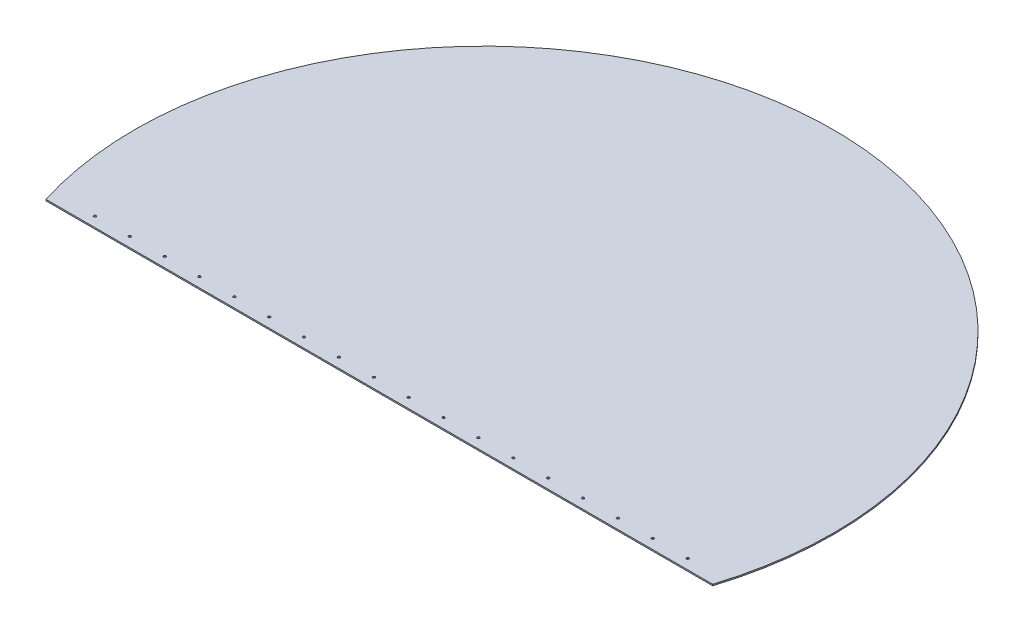
ISO-10303-21;
HEADER;
FILE_DESCRIPTION(('STEP AP214'),'2;1');
FILE_NAME('part.step','',(''),(''),'','','');
FILE_SCHEMA(('AUTOMOTIVE_DESIGN { 1 0 10303 214 1 1 1 1 }'));
ENDSEC;
DATA;
#1=APPLICATION_CONTEXT('core data for automotive mechanical design processes');
#2=APPLICATION_PROTOCOL_DEFINITION('international standard','automotive_design',2000,#1);
#3=PRODUCT_CONTEXT('',#1,'mechanical');
#4=PRODUCT('Part','Part','',(#3));
#5=PRODUCT_RELATED_PRODUCT_CATEGORY('part','',(#4));
#6=PRODUCT_DEFINITION_FORMATION('','',#4);
#7=PRODUCT_DEFINITION_CONTEXT('part definition',#1,'design');
#8=PRODUCT_DEFINITION('design','',#6,#7);
#9=PRODUCT_DEFINITION_SHAPE('','',#8);
#10=(LENGTH_UNIT() NAMED_UNIT(*) SI_UNIT(.MILLI.,.METRE.));
#11=(NAMED_UNIT(*) PLANE_ANGLE_UNIT() SI_UNIT($,.RADIAN.));
#12=(NAMED_UNIT(*) SI_UNIT($,.STERADIAN.) SOLID_ANGLE_UNIT());
#13=UNCERTAINTY_MEASURE_WITH_UNIT(LENGTH_MEASURE(1.E-05),#10,'distance_accuracy_value','');
#14=(GEOMETRIC_REPRESENTATION_CONTEXT(3) GLOBAL_UNCERTAINTY_ASSIGNED_CONTEXT((#13)) GLOBAL_UNIT_ASSIGNED_CONTEXT((#10,
#11,#12)) REPRESENTATION_CONTEXT('',''));
#15=CARTESIAN_POINT('',(0.,0.,0.));
#16=DIRECTION('',(0.,0.,1.));
#17=DIRECTION('',(1.,0.,0.));
#18=AXIS2_PLACEMENT_3D('',#15,#16,#17);
#19=CARTESIAN_POINT('',(0.,1.98374,0.));
#20=DIRECTION('',(0.,-1.,0.));
#21=DIRECTION('',(0.,0.,-1.));
#22=AXIS2_PLACEMENT_3D('',#19,#20,#21);
#23=CYLINDRICAL_SURFACE('',#22,508.9906);
#24=CARTESIAN_POINT('',(0.,0.,0.));
#25=DIRECTION('',(0.,1.,0.));
#26=DIRECTION('',(0.,0.,1.));
#27=AXIS2_PLACEMENT_3D('',#24,#25,#26);
#28=CIRCLE('',#27,508.9906);
#29=CARTESIAN_POINT('',(485.639445358756,0.,152.4));
#30=VERTEX_POINT('',#29);
#31=CARTESIAN_POINT('',(-485.639445358756,0.,152.4));
#32=VERTEX_POINT('',#31);
#33=EDGE_CURVE('E66',#30,#32,#28,.T.);
#34=ORIENTED_EDGE('',*,*,#33,.T.);
#35=DIRECTION('',(0.,-1.,0.));
#36=VECTOR('',#35,1.);
#37=CARTESIAN_POINT('',(-485.639445358756,1.98374,152.4));
#38=LINE('',#37,#36);
#39=CARTESIAN_POINT('',(-485.639445358756,1.98374,152.4));
#40=VERTEX_POINT('',#39);
#41=EDGE_CURVE('E11',#40,#32,#38,.T.);
#42=ORIENTED_EDGE('',*,*,#41,.F.);
#43=CARTESIAN_POINT('',(0.,1.98374,0.));
#44=DIRECTION('',(0.,1.,0.));
#45=DIRECTION('',(0.,0.,1.));
#46=AXIS2_PLACEMENT_3D('',#43,#44,#45);
#47=CIRCLE('',#46,508.9906);
#48=CARTESIAN_POINT('',(485.639445358756,1.98374,152.4));
#49=VERTEX_POINT('',#48);
#50=EDGE_CURVE('E65',#49,#40,#47,.T.);
#51=ORIENTED_EDGE('',*,*,#50,.F.);
#52=DIRECTION('',(0.,-1.,0.));
#53=VECTOR('',#52,1.);
#54=CARTESIAN_POINT('',(485.639445358756,1.98374,152.4));
#55=LINE('',#54,#53);
#56=EDGE_CURVE('E42',#49,#30,#55,.T.);
#57=ORIENTED_EDGE('',*,*,#56,.T.);
#58=EDGE_LOOP('',(#34,#42,#51,#57));
#59=FACE_BOUND('',#58,.T.);
#60=ADVANCED_FACE('F33',(#59),#23,.T.);
#61=CARTESIAN_POINT('',(-485.639445358756,1.98374,152.4));
#62=DIRECTION('',(0.,0.,-1.));
#63=DIRECTION('',(-1.,0.,0.));
#64=AXIS2_PLACEMENT_3D('',#61,#62,#63);
#65=PLANE('',#64);
#66=DIRECTION('',(1.,0.,0.));
#67=VECTOR('',#66,1.);
#68=CARTESIAN_POINT('',(-485.639445358756,0.,152.4));
#69=LINE('',#68,#67);
#70=EDGE_CURVE('E58',#32,#30,#69,.T.);
#71=ORIENTED_EDGE('',*,*,#70,.T.);
#72=ORIENTED_EDGE('',*,*,#56,.F.);
#73=DIRECTION('',(1.,0.,0.));
#74=VECTOR('',#73,1.);
#75=CARTESIAN_POINT('',(-485.639445358756,1.98374,152.4));
#76=LINE('',#75,#74);
#77=EDGE_CURVE('E50',#40,#49,#76,.T.);
#78=ORIENTED_EDGE('',*,*,#77,.F.);
#79=ORIENTED_EDGE('',*,*,#41,.T.);
#80=EDGE_LOOP('',(#71,#72,#78,#79));
#81=FACE_BOUND('',#80,.T.);
#82=ADVANCED_FACE('F61',(#81),#65,.F.);
#83=CARTESIAN_POINT('',(0.,1.98374,0.));
#84=DIRECTION('',(0.,1.,0.));
#85=DIRECTION('',(0.,0.,1.));
#86=AXIS2_PLACEMENT_3D('',#83,#84,#85);
#87=PLANE('',#86);
#88=CARTESIAN_POINT('',(-428.760554641244,1.98374,138.1125));
#89=DIRECTION('',(0.,1.,0.));
#90=DIRECTION('',(0.,0.,1.));
#91=AXIS2_PLACEMENT_3D('',#88,#89,#90);
#92=CIRCLE('',#91,1.77799999999998);
#93=CARTESIAN_POINT('',(-428.760554641244,1.98374,139.8905));
#94=VERTEX_POINT('',#93);
#95=EDGE_CURVE('E150',#94,#94,#92,.T.);
#96=ORIENTED_EDGE('',*,*,#95,.F.);
#97=EDGE_LOOP('',(#96));
#98=FACE_BOUND('',#97,.T.);
#99=CARTESIAN_POINT('',(-377.960554641244,1.98374,138.1125));
#100=DIRECTION('',(0.,1.,0.));
#101=DIRECTION('',(0.,0.,1.));
#102=AXIS2_PLACEMENT_3D('',#99,#100,#101);
#103=CIRCLE('',#102,1.77799999999998);
#104=CARTESIAN_POINT('',(-377.960554641244,1.98374,139.8905));
#105=VERTEX_POINT('',#104);
#106=EDGE_CURVE('E140',#105,#105,#103,.T.);
#107=ORIENTED_EDGE('',*,*,#106,.F.);
#108=EDGE_LOOP('',(#107));
#109=FACE_BOUND('',#108,.T.);
#110=CARTESIAN_POINT('',(-327.160554641244,1.98374,138.1125));
#111=DIRECTION('',(0.,1.,0.));
#112=DIRECTION('',(0.,0.,1.));
#113=AXIS2_PLACEMENT_3D('',#110,#111,#112);
#114=CIRCLE('',#113,1.77799999999998);
#115=CARTESIAN_POINT('',(-327.160554641244,1.98374,139.8905));
#116=VERTEX_POINT('',#115);
#117=EDGE_CURVE('E137',#116,#116,#114,.T.);
#118=ORIENTED_EDGE('',*,*,#117,.F.);
#119=EDGE_LOOP('',(#118));
#120=FACE_BOUND('',#119,.T.);
#121=CARTESIAN_POINT('',(-276.360554641244,1.98374,138.1125));
#122=DIRECTION('',(0.,1.,0.));
#123=DIRECTION('',(0.,0.,1.));
#124=AXIS2_PLACEMENT_3D('',#121,#122,#123);
#125=CIRCLE('',#124,1.77799999999998);
#126=CARTESIAN_POINT('',(-276.360554641244,1.98374,139.8905));
#127=VERTEX_POINT('',#126);
#128=EDGE_CURVE('E134',#127,#127,#125,.T.);
#129=ORIENTED_EDGE('',*,*,#128,.F.);
#130=EDGE_LOOP('',(#129));
#131=FACE_BOUND('',#130,.T.);
#132=CARTESIAN_POINT('',(-225.560554641244,1.98374,138.1125));
#133=DIRECTION('',(0.,1.,0.));
#134=DIRECTION('',(0.,0.,1.));
#135=AXIS2_PLACEMENT_3D('',#132,#133,#134);
#136=CIRCLE('',#135,1.77799999999998);
#137=CARTESIAN_POINT('',(-225.560554641244,1.98374,139.8905));
#138=VERTEX_POINT('',#137);
#139=EDGE_CURVE('E130',#138,#138,#136,.T.);
#140=ORIENTED_EDGE('',*,*,#139,.F.);
#141=EDGE_LOOP('',(#140));
#142=FACE_BOUND('',#141,.T.);
#143=CARTESIAN_POINT('',(-174.760554641244,1.98374,138.1125));
#144=DIRECTION('',(0.,1.,0.));
#145=DIRECTION('',(0.,0.,1.));
#146=AXIS2_PLACEMENT_3D('',#143,#144,#145);
#147=CIRCLE('',#146,1.77799999999998);
#148=CARTESIAN_POINT('',(-174.760554641244,1.98374,139.8905));
#149=VERTEX_POINT('',#148);
#150=EDGE_CURVE('E126',#149,#149,#147,.T.);
#151=ORIENTED_EDGE('',*,*,#150,.F.);
#152=EDGE_LOOP('',(#151));
#153=FACE_BOUND('',#152,.T.);
#154=CARTESIAN_POINT('',(-123.960554641244,1.98374,138.1125));
#155=DIRECTION('',(0.,1.,0.));
#156=DIRECTION('',(0.,0.,1.));
#157=AXIS2_PLACEMENT_3D('',#154,#155,#156);
#158=CIRCLE('',#157,1.77799999999998);
#159=CARTESIAN_POINT('',(-123.960554641244,1.98374,139.8905));
#160=VERTEX_POINT('',#159);
#161=EDGE_CURVE('E122',#160,#160,#158,.T.);
#162=ORIENTED_EDGE('',*,*,#161,.F.);
#163=EDGE_LOOP('',(#162));
#164=FACE_BOUND('',#163,.T.);
#165=CARTESIAN_POINT('',(-73.1605546412441,1.98374,138.1125));
#166=DIRECTION('',(0.,1.,0.));
#167=DIRECTION('',(0.,0.,1.));
#168=AXIS2_PLACEMENT_3D('',#165,#166,#167);
#169=CIRCLE('',#168,1.77799999999998);
#170=CARTESIAN_POINT('',(-73.1605546412441,1.98374,139.8905));
#171=VERTEX_POINT('',#170);
#172=EDGE_CURVE('E118',#171,#171,#169,.T.);
#173=ORIENTED_EDGE('',*,*,#172,.F.);
#174=EDGE_LOOP('',(#173));
#175=FACE_BOUND('',#174,.T.);
#176=CARTESIAN_POINT('',(-22.3605546412441,1.98374,138.1125));
#177=DIRECTION('',(0.,1.,0.));
#178=DIRECTION('',(0.,0.,1.));
#179=AXIS2_PLACEMENT_3D('',#176,#177,#178);
#180=CIRCLE('',#179,1.77799999999998);
#181=CARTESIAN_POINT('',(-22.3605546412441,1.98374,139.8905));
#182=VERTEX_POINT('',#181);
#183=EDGE_CURVE('E114',#182,#182,#180,.T.);
#184=ORIENTED_EDGE('',*,*,#183,.F.);
#185=EDGE_LOOP('',(#184));
#186=FACE_BOUND('',#185,.T.);
#187=CARTESIAN_POINT('',(28.4394453587559,1.98374,138.1125));
#188=DIRECTION('',(0.,1.,0.));
#189=DIRECTION('',(0.,0.,1.));
#190=AXIS2_PLACEMENT_3D('',#187,#188,#189);
#191=CIRCLE('',#190,1.77799999999998);
#192=CARTESIAN_POINT('',(28.4394453587559,1.98374,139.8905));
#193=VERTEX_POINT('',#192);
#194=EDGE_CURVE('E110',#193,#193,#191,.T.);
#195=ORIENTED_EDGE('',*,*,#194,.F.);
#196=EDGE_LOOP('',(#195));
#197=FACE_BOUND('',#196,.T.);
#198=CARTESIAN_POINT('',(79.2394453587559,1.98374,138.1125));
#199=DIRECTION('',(0.,1.,0.));
#200=DIRECTION('',(0.,0.,1.));
#201=AXIS2_PLACEMENT_3D('',#198,#199,#200);
#202=CIRCLE('',#201,1.77799999999998);
#203=CARTESIAN_POINT('',(79.2394453587559,1.98374,139.8905));
#204=VERTEX_POINT('',#203);
#205=EDGE_CURVE('E106',#204,#204,#202,.T.);
#206=ORIENTED_EDGE('',*,*,#205,.F.);
#207=EDGE_LOOP('',(#206));
#208=FACE_BOUND('',#207,.T.);
#209=CARTESIAN_POINT('',(130.039445358756,1.98374,138.1125));
#210=DIRECTION('',(0.,1.,0.));
#211=DIRECTION('',(0.,0.,1.));
#212=AXIS2_PLACEMENT_3D('',#209,#210,#211);
#213=CIRCLE('',#212,1.77799999999998);
#214=CARTESIAN_POINT('',(130.039445358756,1.98374,139.8905));
#215=VERTEX_POINT('',#214);
#216=EDGE_CURVE('E102',#215,#215,#213,.T.);
#217=ORIENTED_EDGE('',*,*,#216,.F.);
#218=EDGE_LOOP('',(#217));
#219=FACE_BOUND('',#218,.T.);
#220=CARTESIAN_POINT('',(180.839445358756,1.98374,138.1125));
#221=DIRECTION('',(0.,1.,0.));
#222=DIRECTION('',(0.,0.,1.));
#223=AXIS2_PLACEMENT_3D('',#220,#221,#222);
#224=CIRCLE('',#223,1.77799999999998);
#225=CARTESIAN_POINT('',(180.839445358756,1.98374,139.8905));
#226=VERTEX_POINT('',#225);
#227=EDGE_CURVE('E98',#226,#226,#224,.T.);
#228=ORIENTED_EDGE('',*,*,#227,.F.);
#229=EDGE_LOOP('',(#228));
#230=FACE_BOUND('',#229,.T.);
#231=CARTESIAN_POINT('',(231.639445358756,1.98374,138.1125));
#232=DIRECTION('',(0.,1.,0.));
#233=DIRECTION('',(0.,0.,1.));
#234=AXIS2_PLACEMENT_3D('',#231,#232,#233);
#235=CIRCLE('',#234,1.77799999999998);
#236=CARTESIAN_POINT('',(231.639445358756,1.98374,139.8905));
#237=VERTEX_POINT('',#236);
#238=EDGE_CURVE('E94',#237,#237,#235,.T.);
#239=ORIENTED_EDGE('',*,*,#238,.F.);
#240=EDGE_LOOP('',(#239));
#241=FACE_BOUND('',#240,.T.);
#242=CARTESIAN_POINT('',(282.439445358756,1.98374,138.1125));
#243=DIRECTION('',(0.,1.,0.));
#244=DIRECTION('',(0.,0.,1.));
#245=AXIS2_PLACEMENT_3D('',#242,#243,#244);
#246=CIRCLE('',#245,1.77799999999998);
#247=CARTESIAN_POINT('',(282.439445358756,1.98374,139.8905));
#248=VERTEX_POINT('',#247);
#249=EDGE_CURVE('E90',#248,#248,#246,.T.);
#250=ORIENTED_EDGE('',*,*,#249,.F.);
#251=EDGE_LOOP('',(#250));
#252=FACE_BOUND('',#251,.T.);
#253=CARTESIAN_POINT('',(333.239445358756,1.98374,138.1125));
#254=DIRECTION('',(0.,1.,0.));
#255=DIRECTION('',(0.,0.,1.));
#256=AXIS2_PLACEMENT_3D('',#253,#254,#255);
#257=CIRCLE('',#256,1.77799999999998);
#258=CARTESIAN_POINT('',(333.239445358756,1.98374,139.8905));
#259=VERTEX_POINT('',#258);
#260=EDGE_CURVE('E86',#259,#259,#257,.T.);
#261=ORIENTED_EDGE('',*,*,#260,.F.);
#262=EDGE_LOOP('',(#261));
#263=FACE_BOUND('',#262,.T.);
#264=CARTESIAN_POINT('',(384.039445358756,1.98374,138.1125));
#265=DIRECTION('',(0.,1.,0.));
#266=DIRECTION('',(0.,0.,1.));
#267=AXIS2_PLACEMENT_3D('',#264,#265,#266);
#268=CIRCLE('',#267,1.77799999999998);
#269=CARTESIAN_POINT('',(384.039445358756,1.98374,139.8905));
#270=VERTEX_POINT('',#269);
#271=EDGE_CURVE('E82',#270,#270,#268,.T.);
#272=ORIENTED_EDGE('',*,*,#271,.F.);
#273=EDGE_LOOP('',(#272));
#274=FACE_BOUND('',#273,.T.);
#275=CARTESIAN_POINT('',(434.839445358756,1.98374,138.1125));
#276=DIRECTION('',(0.,1.,0.));
#277=DIRECTION('',(0.,0.,1.));
#278=AXIS2_PLACEMENT_3D('',#275,#276,#277);
#279=CIRCLE('',#278,1.77799999999998);
#280=CARTESIAN_POINT('',(434.839445358756,1.98374,139.8905));
#281=VERTEX_POINT('',#280);
#282=EDGE_CURVE('E74',#281,#281,#279,.T.);
#283=ORIENTED_EDGE('',*,*,#282,.F.);
#284=EDGE_LOOP('',(#283));
#285=FACE_BOUND('',#284,.T.);
#286=ORIENTED_EDGE('',*,*,#50,.T.);
#287=ORIENTED_EDGE('',*,*,#77,.T.);
#288=EDGE_LOOP('',(#286,#287));
#289=FACE_BOUND('',#288,.T.);
#290=ADVANCED_FACE('F182',(#98,#109,#120,#131,#142,#153,#164,#175,#186,#197,#208,#219,#230,#241,
#252,#263,#274,#285,#289),#87,.T.);
#291=CARTESIAN_POINT('',(0.,0.,0.));
#292=DIRECTION('',(0.,1.,0.));
#293=DIRECTION('',(0.,0.,1.));
#294=AXIS2_PLACEMENT_3D('',#291,#292,#293);
#295=PLANE('',#294);
#296=CARTESIAN_POINT('',(-428.760554641244,0.,138.1125));
#297=DIRECTION('',(0.,1.,0.));
#298=DIRECTION('',(0.,0.,1.));
#299=AXIS2_PLACEMENT_3D('',#296,#297,#298);
#300=CIRCLE('',#299,1.77799999999998);
#301=CARTESIAN_POINT('',(-428.760554641244,0.,139.8905));
#302=VERTEX_POINT('',#301);
#303=EDGE_CURVE('E36',#302,#302,#300,.T.);
#304=ORIENTED_EDGE('',*,*,#303,.T.);
#305=EDGE_LOOP('',(#304));
#306=FACE_BOUND('',#305,.T.);
#307=CARTESIAN_POINT('',(-377.960554641244,0.,138.1125));
#308=DIRECTION('',(0.,1.,0.));
#309=DIRECTION('',(0.,0.,1.));
#310=AXIS2_PLACEMENT_3D('',#307,#308,#309);
#311=CIRCLE('',#310,1.77799999999998);
#312=CARTESIAN_POINT('',(-377.960554641244,0.,139.8905));
#313=VERTEX_POINT('',#312);
#314=EDGE_CURVE('E138',#313,#313,#311,.T.);
#315=ORIENTED_EDGE('',*,*,#314,.T.);
#316=EDGE_LOOP('',(#315));
#317=FACE_BOUND('',#316,.T.);
#318=CARTESIAN_POINT('',(-327.160554641244,0.,138.1125));
#319=DIRECTION('',(0.,1.,0.));
#320=DIRECTION('',(0.,0.,1.));
#321=AXIS2_PLACEMENT_3D('',#318,#319,#320);
#322=CIRCLE('',#321,1.77799999999998);
#323=CARTESIAN_POINT('',(-327.160554641244,0.,139.8905));
#324=VERTEX_POINT('',#323);
#325=EDGE_CURVE('E135',#324,#324,#322,.T.);
#326=ORIENTED_EDGE('',*,*,#325,.T.);
#327=EDGE_LOOP('',(#326));
#328=FACE_BOUND('',#327,.T.);
#329=CARTESIAN_POINT('',(-276.360554641244,0.,138.1125));
#330=DIRECTION('',(0.,1.,0.));
#331=DIRECTION('',(0.,0.,1.));
#332=AXIS2_PLACEMENT_3D('',#329,#330,#331);
#333=CIRCLE('',#332,1.77799999999998);
#334=CARTESIAN_POINT('',(-276.360554641244,0.,139.8905));
#335=VERTEX_POINT('',#334);
#336=EDGE_CURVE('E131',#335,#335,#333,.T.);
#337=ORIENTED_EDGE('',*,*,#336,.T.);
#338=EDGE_LOOP('',(#337));
#339=FACE_BOUND('',#338,.T.);
#340=CARTESIAN_POINT('',(-225.560554641244,0.,138.1125));
#341=DIRECTION('',(0.,1.,0.));
#342=DIRECTION('',(0.,0.,1.));
#343=AXIS2_PLACEMENT_3D('',#340,#341,#342);
#344=CIRCLE('',#343,1.77799999999998);
#345=CARTESIAN_POINT('',(-225.560554641244,0.,139.8905));
#346=VERTEX_POINT('',#345);
#347=EDGE_CURVE('E127',#346,#346,#344,.T.);
#348=ORIENTED_EDGE('',*,*,#347,.T.);
#349=EDGE_LOOP('',(#348));
#350=FACE_BOUND('',#349,.T.);
#351=CARTESIAN_POINT('',(-174.760554641244,0.,138.1125));
#352=DIRECTION('',(0.,1.,0.));
#353=DIRECTION('',(0.,0.,1.));
#354=AXIS2_PLACEMENT_3D('',#351,#352,#353);
#355=CIRCLE('',#354,1.77799999999998);
#356=CARTESIAN_POINT('',(-174.760554641244,0.,139.8905));
#357=VERTEX_POINT('',#356);
#358=EDGE_CURVE('E123',#357,#357,#355,.T.);
#359=ORIENTED_EDGE('',*,*,#358,.T.);
#360=EDGE_LOOP('',(#359));
#361=FACE_BOUND('',#360,.T.);
#362=CARTESIAN_POINT('',(-123.960554641244,0.,138.1125));
#363=DIRECTION('',(0.,1.,0.));
#364=DIRECTION('',(0.,0.,1.));
#365=AXIS2_PLACEMENT_3D('',#362,#363,#364);
#366=CIRCLE('',#365,1.77799999999998);
#367=CARTESIAN_POINT('',(-123.960554641244,0.,139.8905));
#368=VERTEX_POINT('',#367);
#369=EDGE_CURVE('E119',#368,#368,#366,.T.);
#370=ORIENTED_EDGE('',*,*,#369,.T.);
#371=EDGE_LOOP('',(#370));
#372=FACE_BOUND('',#371,.T.);
#373=CARTESIAN_POINT('',(-73.1605546412441,0.,138.1125));
#374=DIRECTION('',(0.,1.,0.));
#375=DIRECTION('',(0.,0.,1.));
#376=AXIS2_PLACEMENT_3D('',#373,#374,#375);
#377=CIRCLE('',#376,1.77799999999998);
#378=CARTESIAN_POINT('',(-73.1605546412441,0.,139.8905));
#379=VERTEX_POINT('',#378);
#380=EDGE_CURVE('E115',#379,#379,#377,.T.);
#381=ORIENTED_EDGE('',*,*,#380,.T.);
#382=EDGE_LOOP('',(#381));
#383=FACE_BOUND('',#382,.T.);
#384=CARTESIAN_POINT('',(-22.3605546412441,0.,138.1125));
#385=DIRECTION('',(0.,1.,0.));
#386=DIRECTION('',(0.,0.,1.));
#387=AXIS2_PLACEMENT_3D('',#384,#385,#386);
#388=CIRCLE('',#387,1.77799999999998);
#389=CARTESIAN_POINT('',(-22.3605546412441,0.,139.8905));
#390=VERTEX_POINT('',#389);
#391=EDGE_CURVE('E111',#390,#390,#388,.T.);
#392=ORIENTED_EDGE('',*,*,#391,.T.);
#393=EDGE_LOOP('',(#392));
#394=FACE_BOUND('',#393,.T.);
#395=CARTESIAN_POINT('',(28.4394453587559,0.,138.1125));
#396=DIRECTION('',(0.,1.,0.));
#397=DIRECTION('',(0.,0.,1.));
#398=AXIS2_PLACEMENT_3D('',#395,#396,#397);
#399=CIRCLE('',#398,1.77799999999998);
#400=CARTESIAN_POINT('',(28.4394453587559,0.,139.8905));
#401=VERTEX_POINT('',#400);
#402=EDGE_CURVE('E107',#401,#401,#399,.T.);
#403=ORIENTED_EDGE('',*,*,#402,.T.);
#404=EDGE_LOOP('',(#403));
#405=FACE_BOUND('',#404,.T.);
#406=CARTESIAN_POINT('',(79.2394453587559,0.,138.1125));
#407=DIRECTION('',(0.,1.,0.));
#408=DIRECTION('',(0.,0.,1.));
#409=AXIS2_PLACEMENT_3D('',#406,#407,#408);
#410=CIRCLE('',#409,1.77799999999998);
#411=CARTESIAN_POINT('',(79.2394453587559,0.,139.8905));
#412=VERTEX_POINT('',#411);
#413=EDGE_CURVE('E103',#412,#412,#410,.T.);
#414=ORIENTED_EDGE('',*,*,#413,.T.);
#415=EDGE_LOOP('',(#414));
#416=FACE_BOUND('',#415,.T.);
#417=CARTESIAN_POINT('',(130.039445358756,0.,138.1125));
#418=DIRECTION('',(0.,1.,0.));
#419=DIRECTION('',(0.,0.,1.));
#420=AXIS2_PLACEMENT_3D('',#417,#418,#419);
#421=CIRCLE('',#420,1.77799999999998);
#422=CARTESIAN_POINT('',(130.039445358756,0.,139.8905));
#423=VERTEX_POINT('',#422);
#424=EDGE_CURVE('E99',#423,#423,#421,.T.);
#425=ORIENTED_EDGE('',*,*,#424,.T.);
#426=EDGE_LOOP('',(#425));
#427=FACE_BOUND('',#426,.T.);
#428=CARTESIAN_POINT('',(180.839445358756,0.,138.1125));
#429=DIRECTION('',(0.,1.,0.));
#430=DIRECTION('',(0.,0.,1.));
#431=AXIS2_PLACEMENT_3D('',#428,#429,#430);
#432=CIRCLE('',#431,1.77799999999998);
#433=CARTESIAN_POINT('',(180.839445358756,0.,139.8905));
#434=VERTEX_POINT('',#433);
#435=EDGE_CURVE('E95',#434,#434,#432,.T.);
#436=ORIENTED_EDGE('',*,*,#435,.T.);
#437=EDGE_LOOP('',(#436));
#438=FACE_BOUND('',#437,.T.);
#439=CARTESIAN_POINT('',(231.639445358756,0.,138.1125));
#440=DIRECTION('',(0.,1.,0.));
#441=DIRECTION('',(0.,0.,1.));
#442=AXIS2_PLACEMENT_3D('',#439,#440,#441);
#443=CIRCLE('',#442,1.77799999999998);
#444=CARTESIAN_POINT('',(231.639445358756,0.,139.8905));
#445=VERTEX_POINT('',#444);
#446=EDGE_CURVE('E91',#445,#445,#443,.T.);
#447=ORIENTED_EDGE('',*,*,#446,.T.);
#448=EDGE_LOOP('',(#447));
#449=FACE_BOUND('',#448,.T.);
#450=CARTESIAN_POINT('',(282.439445358756,0.,138.1125));
#451=DIRECTION('',(0.,1.,0.));
#452=DIRECTION('',(0.,0.,1.));
#453=AXIS2_PLACEMENT_3D('',#450,#451,#452);
#454=CIRCLE('',#453,1.77799999999998);
#455=CARTESIAN_POINT('',(282.439445358756,0.,139.8905));
#456=VERTEX_POINT('',#455);
#457=EDGE_CURVE('E87',#456,#456,#454,.T.);
#458=ORIENTED_EDGE('',*,*,#457,.T.);
#459=EDGE_LOOP('',(#458));
#460=FACE_BOUND('',#459,.T.);
#461=CARTESIAN_POINT('',(333.239445358756,0.,138.1125));
#462=DIRECTION('',(0.,1.,0.));
#463=DIRECTION('',(0.,0.,1.));
#464=AXIS2_PLACEMENT_3D('',#461,#462,#463);
#465=CIRCLE('',#464,1.77799999999998);
#466=CARTESIAN_POINT('',(333.239445358756,0.,139.8905));
#467=VERTEX_POINT('',#466);
#468=EDGE_CURVE('E83',#467,#467,#465,.T.);
#469=ORIENTED_EDGE('',*,*,#468,.T.);
#470=EDGE_LOOP('',(#469));
#471=FACE_BOUND('',#470,.T.);
#472=CARTESIAN_POINT('',(384.039445358756,0.,138.1125));
#473=DIRECTION('',(0.,1.,0.));
#474=DIRECTION('',(0.,0.,1.));
#475=AXIS2_PLACEMENT_3D('',#472,#473,#474);
#476=CIRCLE('',#475,1.77799999999998);
#477=CARTESIAN_POINT('',(384.039445358756,0.,139.8905));
#478=VERTEX_POINT('',#477);
#479=EDGE_CURVE('E79',#478,#478,#476,.T.);
#480=ORIENTED_EDGE('',*,*,#479,.T.);
#481=EDGE_LOOP('',(#480));
#482=FACE_BOUND('',#481,.T.);
#483=CARTESIAN_POINT('',(434.839445358756,0.,138.1125));
#484=DIRECTION('',(0.,1.,0.));
#485=DIRECTION('',(0.,0.,1.));
#486=AXIS2_PLACEMENT_3D('',#483,#484,#485);
#487=CIRCLE('',#486,1.77799999999998);
#488=CARTESIAN_POINT('',(434.839445358756,0.,139.8905));
#489=VERTEX_POINT('',#488);
#490=EDGE_CURVE('E71',#489,#489,#487,.T.);
#491=ORIENTED_EDGE('',*,*,#490,.T.);
#492=EDGE_LOOP('',(#491));
#493=FACE_BOUND('',#492,.T.);
#494=ORIENTED_EDGE('',*,*,#33,.F.);
#495=ORIENTED_EDGE('',*,*,#70,.F.);
#496=EDGE_LOOP('',(#494,#495));
#497=FACE_BOUND('',#496,.T.);
#498=ADVANCED_FACE('F70',(#306,#317,#328,#339,#350,#361,#372,#383,#394,#405,#416,#427,#438,#449,
#460,#471,#482,#493,#497),#295,.F.);
#499=CARTESIAN_POINT('',(434.839445358756,-1.19126,138.1125));
#500=DIRECTION('',(0.,1.,0.));
#501=DIRECTION('',(0.,0.,1.));
#502=AXIS2_PLACEMENT_3D('',#499,#500,#501);
#503=CYLINDRICAL_SURFACE('',#502,1.77799999999998);
#504=ORIENTED_EDGE('',*,*,#282,.T.);
#505=EDGE_LOOP('',(#504));
#506=FACE_BOUND('',#505,.T.);
#507=ORIENTED_EDGE('',*,*,#490,.F.);
#508=EDGE_LOOP('',(#507));
#509=FACE_BOUND('',#508,.T.);
#510=ADVANCED_FACE('F190',(#506,#509),#503,.F.);
#511=CARTESIAN_POINT('',(384.039445358756,-1.19126,138.1125));
#512=DIRECTION('',(0.,1.,0.));
#513=DIRECTION('',(0.,0.,1.));
#514=AXIS2_PLACEMENT_3D('',#511,#512,#513);
#515=CYLINDRICAL_SURFACE('',#514,1.77799999999998);
#516=ORIENTED_EDGE('',*,*,#271,.T.);
#517=EDGE_LOOP('',(#516));
#518=FACE_BOUND('',#517,.T.);
#519=ORIENTED_EDGE('',*,*,#479,.F.);
#520=EDGE_LOOP('',(#519));
#521=FACE_BOUND('',#520,.T.);
#522=ADVANCED_FACE('F212',(#518,#521),#515,.F.);
#523=CARTESIAN_POINT('',(333.239445358756,-1.19126,138.1125));
#524=DIRECTION('',(0.,1.,0.));
#525=DIRECTION('',(0.,0.,1.));
#526=AXIS2_PLACEMENT_3D('',#523,#524,#525);
#527=CYLINDRICAL_SURFACE('',#526,1.77799999999998);
#528=ORIENTED_EDGE('',*,*,#260,.T.);
#529=EDGE_LOOP('',(#528));
#530=FACE_BOUND('',#529,.T.);
#531=ORIENTED_EDGE('',*,*,#468,.F.);
#532=EDGE_LOOP('',(#531));
#533=FACE_BOUND('',#532,.T.);
#534=ADVANCED_FACE('F231',(#530,#533),#527,.F.);
#535=CARTESIAN_POINT('',(282.439445358756,-1.19126,138.1125));
#536=DIRECTION('',(0.,1.,0.));
#537=DIRECTION('',(0.,0.,1.));
#538=AXIS2_PLACEMENT_3D('',#535,#536,#537);
#539=CYLINDRICAL_SURFACE('',#538,1.77799999999998);
#540=ORIENTED_EDGE('',*,*,#249,.T.);
#541=EDGE_LOOP('',(#540));
#542=FACE_BOUND('',#541,.T.);
#543=ORIENTED_EDGE('',*,*,#457,.F.);
#544=EDGE_LOOP('',(#543));
#545=FACE_BOUND('',#544,.T.);
#546=ADVANCED_FACE('F241',(#542,#545),#539,.F.);
#547=CARTESIAN_POINT('',(231.639445358756,-1.19126,138.1125));
#548=DIRECTION('',(0.,1.,0.));
#549=DIRECTION('',(0.,0.,1.));
#550=AXIS2_PLACEMENT_3D('',#547,#548,#549);
#551=CYLINDRICAL_SURFACE('',#550,1.77799999999998);
#552=ORIENTED_EDGE('',*,*,#238,.T.);
#553=EDGE_LOOP('',(#552));
#554=FACE_BOUND('',#553,.T.);
#555=ORIENTED_EDGE('',*,*,#446,.F.);
#556=EDGE_LOOP('',(#555));
#557=FACE_BOUND('',#556,.T.);
#558=ADVANCED_FACE('F251',(#554,#557),#551,.F.);
#559=CARTESIAN_POINT('',(180.839445358756,-1.19126,138.1125));
#560=DIRECTION('',(0.,1.,0.));
#561=DIRECTION('',(0.,0.,1.));
#562=AXIS2_PLACEMENT_3D('',#559,#560,#561);
#563=CYLINDRICAL_SURFACE('',#562,1.77799999999998);
#564=ORIENTED_EDGE('',*,*,#227,.T.);
#565=EDGE_LOOP('',(#564));
#566=FACE_BOUND('',#565,.T.);
#567=ORIENTED_EDGE('',*,*,#435,.F.);
#568=EDGE_LOOP('',(#567));
#569=FACE_BOUND('',#568,.T.);
#570=ADVANCED_FACE('F261',(#566,#569),#563,.F.);
#571=CARTESIAN_POINT('',(130.039445358756,-1.19126,138.1125));
#572=DIRECTION('',(0.,1.,0.));
#573=DIRECTION('',(0.,0.,1.));
#574=AXIS2_PLACEMENT_3D('',#571,#572,#573);
#575=CYLINDRICAL_SURFACE('',#574,1.77799999999998);
#576=ORIENTED_EDGE('',*,*,#216,.T.);
#577=EDGE_LOOP('',(#576));
#578=FACE_BOUND('',#577,.T.);
#579=ORIENTED_EDGE('',*,*,#424,.F.);
#580=EDGE_LOOP('',(#579));
#581=FACE_BOUND('',#580,.T.);
#582=ADVANCED_FACE('F271',(#578,#581),#575,.F.);
#583=CARTESIAN_POINT('',(79.2394453587559,-1.19126,138.1125));
#584=DIRECTION('',(0.,1.,0.));
#585=DIRECTION('',(0.,0.,1.));
#586=AXIS2_PLACEMENT_3D('',#583,#584,#585);
#587=CYLINDRICAL_SURFACE('',#586,1.77799999999998);
#588=ORIENTED_EDGE('',*,*,#205,.T.);
#589=EDGE_LOOP('',(#588));
#590=FACE_BOUND('',#589,.T.);
#591=ORIENTED_EDGE('',*,*,#413,.F.);
#592=EDGE_LOOP('',(#591));
#593=FACE_BOUND('',#592,.T.);
#594=ADVANCED_FACE('F281',(#590,#593),#587,.F.);
#595=CARTESIAN_POINT('',(28.4394453587559,-1.19126,138.1125));
#596=DIRECTION('',(0.,1.,0.));
#597=DIRECTION('',(0.,0.,1.));
#598=AXIS2_PLACEMENT_3D('',#595,#596,#597);
#599=CYLINDRICAL_SURFACE('',#598,1.77799999999998);
#600=ORIENTED_EDGE('',*,*,#194,.T.);
#601=EDGE_LOOP('',(#600));
#602=FACE_BOUND('',#601,.T.);
#603=ORIENTED_EDGE('',*,*,#402,.F.);
#604=EDGE_LOOP('',(#603));
#605=FACE_BOUND('',#604,.T.);
#606=ADVANCED_FACE('F291',(#602,#605),#599,.F.);
#607=CARTESIAN_POINT('',(-22.3605546412441,-1.19126,138.1125));
#608=DIRECTION('',(0.,1.,0.));
#609=DIRECTION('',(0.,0.,1.));
#610=AXIS2_PLACEMENT_3D('',#607,#608,#609);
#611=CYLINDRICAL_SURFACE('',#610,1.77799999999998);
#612=ORIENTED_EDGE('',*,*,#183,.T.);
#613=EDGE_LOOP('',(#612));
#614=FACE_BOUND('',#613,.T.);
#615=ORIENTED_EDGE('',*,*,#391,.F.);
#616=EDGE_LOOP('',(#615));
#617=FACE_BOUND('',#616,.T.);
#618=ADVANCED_FACE('F301',(#614,#617),#611,.F.);
#619=CARTESIAN_POINT('',(-73.1605546412441,-1.19126,138.1125));
#620=DIRECTION('',(0.,1.,0.));
#621=DIRECTION('',(0.,0.,1.));
#622=AXIS2_PLACEMENT_3D('',#619,#620,#621);
#623=CYLINDRICAL_SURFACE('',#622,1.77799999999998);
#624=ORIENTED_EDGE('',*,*,#172,.T.);
#625=EDGE_LOOP('',(#624));
#626=FACE_BOUND('',#625,.T.);
#627=ORIENTED_EDGE('',*,*,#380,.F.);
#628=EDGE_LOOP('',(#627));
#629=FACE_BOUND('',#628,.T.);
#630=ADVANCED_FACE('F311',(#626,#629),#623,.F.);
#631=CARTESIAN_POINT('',(-123.960554641244,-1.19126,138.1125));
#632=DIRECTION('',(0.,1.,0.));
#633=DIRECTION('',(0.,0.,1.));
#634=AXIS2_PLACEMENT_3D('',#631,#632,#633);
#635=CYLINDRICAL_SURFACE('',#634,1.77799999999998);
#636=ORIENTED_EDGE('',*,*,#161,.T.);
#637=EDGE_LOOP('',(#636));
#638=FACE_BOUND('',#637,.T.);
#639=ORIENTED_EDGE('',*,*,#369,.F.);
#640=EDGE_LOOP('',(#639));
#641=FACE_BOUND('',#640,.T.);
#642=ADVANCED_FACE('F321',(#638,#641),#635,.F.);
#643=CARTESIAN_POINT('',(-174.760554641244,-1.19126,138.1125));
#644=DIRECTION('',(0.,1.,0.));
#645=DIRECTION('',(0.,0.,1.));
#646=AXIS2_PLACEMENT_3D('',#643,#644,#645);
#647=CYLINDRICAL_SURFACE('',#646,1.77799999999998);
#648=ORIENTED_EDGE('',*,*,#150,.T.);
#649=EDGE_LOOP('',(#648));
#650=FACE_BOUND('',#649,.T.);
#651=ORIENTED_EDGE('',*,*,#358,.F.);
#652=EDGE_LOOP('',(#651));
#653=FACE_BOUND('',#652,.T.);
#654=ADVANCED_FACE('F331',(#650,#653),#647,.F.);
#655=CARTESIAN_POINT('',(-225.560554641244,-1.19126,138.1125));
#656=DIRECTION('',(0.,1.,0.));
#657=DIRECTION('',(0.,0.,1.));
#658=AXIS2_PLACEMENT_3D('',#655,#656,#657);
#659=CYLINDRICAL_SURFACE('',#658,1.77799999999998);
#660=ORIENTED_EDGE('',*,*,#139,.T.);
#661=EDGE_LOOP('',(#660));
#662=FACE_BOUND('',#661,.T.);
#663=ORIENTED_EDGE('',*,*,#347,.F.);
#664=EDGE_LOOP('',(#663));
#665=FACE_BOUND('',#664,.T.);
#666=ADVANCED_FACE('F341',(#662,#665),#659,.F.);
#667=CARTESIAN_POINT('',(-276.360554641244,-1.19126,138.1125));
#668=DIRECTION('',(0.,1.,0.));
#669=DIRECTION('',(0.,0.,1.));
#670=AXIS2_PLACEMENT_3D('',#667,#668,#669);
#671=CYLINDRICAL_SURFACE('',#670,1.77799999999998);
#672=ORIENTED_EDGE('',*,*,#128,.T.);
#673=EDGE_LOOP('',(#672));
#674=FACE_BOUND('',#673,.T.);
#675=ORIENTED_EDGE('',*,*,#336,.F.);
#676=EDGE_LOOP('',(#675));
#677=FACE_BOUND('',#676,.T.);
#678=ADVANCED_FACE('F351',(#674,#677),#671,.F.);
#679=CARTESIAN_POINT('',(-327.160554641244,-1.19126,138.1125));
#680=DIRECTION('',(0.,1.,0.));
#681=DIRECTION('',(0.,0.,1.));
#682=AXIS2_PLACEMENT_3D('',#679,#680,#681);
#683=CYLINDRICAL_SURFACE('',#682,1.77799999999998);
#684=ORIENTED_EDGE('',*,*,#117,.T.);
#685=EDGE_LOOP('',(#684));
#686=FACE_BOUND('',#685,.T.);
#687=ORIENTED_EDGE('',*,*,#325,.F.);
#688=EDGE_LOOP('',(#687));
#689=FACE_BOUND('',#688,.T.);
#690=ADVANCED_FACE('F361',(#686,#689),#683,.F.);
#691=CARTESIAN_POINT('',(-377.960554641244,-1.19126,138.1125));
#692=DIRECTION('',(0.,1.,0.));
#693=DIRECTION('',(0.,0.,1.));
#694=AXIS2_PLACEMENT_3D('',#691,#692,#693);
#695=CYLINDRICAL_SURFACE('',#694,1.77799999999998);
#696=ORIENTED_EDGE('',*,*,#106,.T.);
#697=EDGE_LOOP('',(#696));
#698=FACE_BOUND('',#697,.T.);
#699=ORIENTED_EDGE('',*,*,#314,.F.);
#700=EDGE_LOOP('',(#699));
#701=FACE_BOUND('',#700,.T.);
#702=ADVANCED_FACE('F371',(#698,#701),#695,.F.);
#703=CARTESIAN_POINT('',(-428.760554641244,-1.19126,138.1125));
#704=DIRECTION('',(0.,1.,0.));
#705=DIRECTION('',(0.,0.,1.));
#706=AXIS2_PLACEMENT_3D('',#703,#704,#705);
#707=CYLINDRICAL_SURFACE('',#706,1.77799999999998);
#708=ORIENTED_EDGE('',*,*,#95,.T.);
#709=EDGE_LOOP('',(#708));
#710=FACE_BOUND('',#709,.T.);
#711=ORIENTED_EDGE('',*,*,#303,.F.);
#712=EDGE_LOOP('',(#711));
#713=FACE_BOUND('',#712,.T.);
#714=ADVANCED_FACE('F381',(#710,#713),#707,.F.);
#715=CLOSED_SHELL('',(#60,#82,#290,#498,#510,#522,#534,#546,#558,#570,#582,#594,#606,#618,#630,
#642,#654,#666,#678,#690,#702,#714));
#716=MANIFOLD_SOLID_BREP('B2',#715);
#717=ADVANCED_BREP_SHAPE_REPRESENTATION('',(#18,#716),#14);
#718=SHAPE_DEFINITION_REPRESENTATION(#9,#717);
ENDSEC;
END-ISO-10303-21;
